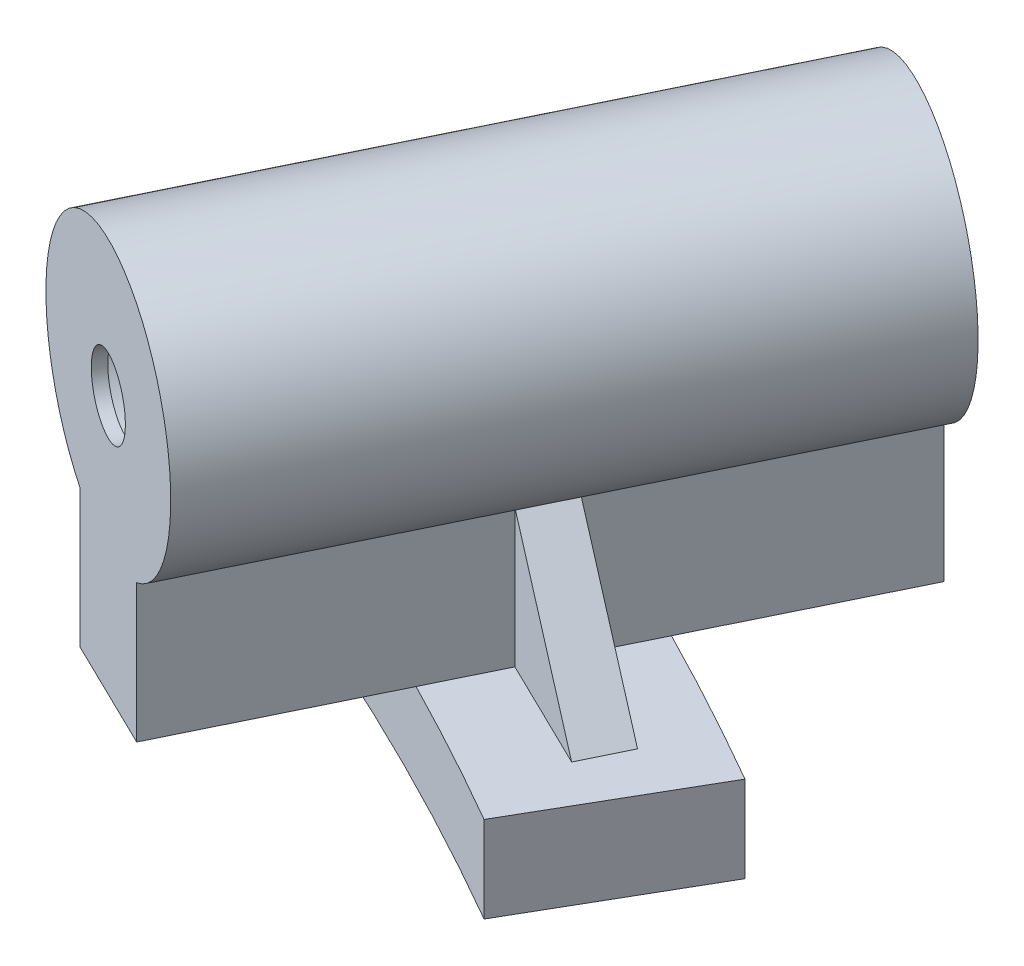
ISO-10303-21;
HEADER;
FILE_DESCRIPTION(('STEP AP214'),'2;1');
FILE_NAME('part.step','',(''),(''),'','','');
FILE_SCHEMA(('AUTOMOTIVE_DESIGN { 1 0 10303 214 1 1 1 1 }'));
ENDSEC;
DATA;
#1=APPLICATION_CONTEXT('core data for automotive mechanical design processes');
#2=APPLICATION_PROTOCOL_DEFINITION('international standard','automotive_design',2000,#1);
#3=PRODUCT_CONTEXT('',#1,'mechanical');
#4=PRODUCT('Part','Part','',(#3));
#5=PRODUCT_RELATED_PRODUCT_CATEGORY('part','',(#4));
#6=PRODUCT_DEFINITION_FORMATION('','',#4);
#7=PRODUCT_DEFINITION_CONTEXT('part definition',#1,'design');
#8=PRODUCT_DEFINITION('design','',#6,#7);
#9=PRODUCT_DEFINITION_SHAPE('','',#8);
#10=(LENGTH_UNIT() NAMED_UNIT(*) SI_UNIT(.MILLI.,.METRE.));
#11=(NAMED_UNIT(*) PLANE_ANGLE_UNIT() SI_UNIT($,.RADIAN.));
#12=(NAMED_UNIT(*) SI_UNIT($,.STERADIAN.) SOLID_ANGLE_UNIT());
#13=UNCERTAINTY_MEASURE_WITH_UNIT(LENGTH_MEASURE(1.E-05),#10,'distance_accuracy_value','');
#14=(GEOMETRIC_REPRESENTATION_CONTEXT(3) GLOBAL_UNCERTAINTY_ASSIGNED_CONTEXT((#13)) GLOBAL_UNIT_ASSIGNED_CONTEXT((#10,
#11,#12)) REPRESENTATION_CONTEXT('',''));
#15=CARTESIAN_POINT('',(0.,0.,0.));
#16=DIRECTION('',(0.,0.,1.));
#17=DIRECTION('',(1.,0.,0.));
#18=AXIS2_PLACEMENT_3D('',#15,#16,#17);
#19=CARTESIAN_POINT('',(99.6195509318094,-1.34114941374719E-13,-215.656208135417));
#20=DIRECTION('',(-0.898794046299167,0.,-0.438371146789078));
#21=DIRECTION('',(-0.438371146789078,0.,0.898794046299167));
#22=AXIS2_PLACEMENT_3D('',#19,#20,#21);
#23=PLANE('',#22);
#24=DIRECTION('',(0.438371146789078,0.,-0.898794046299167));
#25=VECTOR('',#24,1.);
#26=CARTESIAN_POINT('',(99.6195509318094,20.2020410288673,-215.656208135417));
#27=LINE('',#26,#25);
#28=CARTESIAN_POINT('',(117.791632649121,20.2020410288673,-252.914497089915));
#29=VERTEX_POINT('',#28);
#30=CARTESIAN_POINT('',(127.455744952017,20.2020410288673,-272.728863669995));
#31=VERTEX_POINT('',#30);
#32=EDGE_CURVE('E240',#29,#31,#27,.T.);
#33=ORIENTED_EDGE('',*,*,#32,.T.);
#34=DIRECTION('',(0.,-1.,0.));
#35=VECTOR('',#34,1.);
#36=CARTESIAN_POINT('',(127.455744952017,-1.34114941374719E-13,-272.728863669995));
#37=LINE('',#36,#35);
#38=CARTESIAN_POINT('',(127.455744952017,8.99999999991573,-272.728863669995));
#39=VERTEX_POINT('',#38);
#40=EDGE_CURVE('E59',#31,#39,#37,.T.);
#41=ORIENTED_EDGE('',*,*,#40,.T.);
#42=DIRECTION('',(0.438371146789078,0.,-0.898794046299167));
#43=VECTOR('',#42,1.);
#44=CARTESIAN_POINT('',(99.6195509318094,8.99999999991573,-215.656208135417));
#45=LINE('',#44,#43);
#46=CARTESIAN_POINT('',(120.203357984728,8.99999999991573,-257.859266810344));
#47=VERTEX_POINT('',#46);
#48=EDGE_CURVE('E227',#47,#39,#45,.T.);
#49=ORIENTED_EDGE('',*,*,#48,.F.);
#50=CARTESIAN_POINT('',(117.791632649121,8.99999999991573,-252.914497089915));
#51=VERTEX_POINT('',#50);
#52=EDGE_CURVE('E225',#51,#47,#45,.T.);
#53=ORIENTED_EDGE('',*,*,#52,.F.);
#54=DIRECTION('',(0.,1.,0.));
#55=VECTOR('',#54,1.);
#56=CARTESIAN_POINT('',(117.791632649121,-1.34114941374719E-13,-252.914497089915));
#57=LINE('',#56,#55);
#58=EDGE_CURVE('E327',#51,#29,#57,.T.);
#59=ORIENTED_EDGE('',*,*,#58,.T.);
#60=EDGE_LOOP('',(#33,#41,#49,#53,#59));
#61=FACE_BOUND('',#60,.T.);
#62=ADVANCED_FACE('F39',(#61),#23,.T.);
#63=CARTESIAN_POINT('',(108.607491394801,-1.34114941374719E-13,-211.272496667527));
#64=DIRECTION('',(-0.898794046299167,0.,-0.438371146789078));
#65=DIRECTION('',(-0.438371146789078,0.,0.898794046299167));
#66=AXIS2_PLACEMENT_3D('',#63,#64,#65);
#67=PLANE('',#66);
#68=DIRECTION('',(0.,-1.,0.));
#69=VECTOR('',#68,1.);
#70=CARTESIAN_POINT('',(136.443685415008,-1.34114941374719E-13,-268.345152202104));
#71=LINE('',#70,#69);
#72=CARTESIAN_POINT('',(136.443685415008,20.2020410288673,-268.345152202104));
#73=VERTEX_POINT('',#72);
#74=CARTESIAN_POINT('',(136.443685415008,8.99999999991572,-268.345152202104));
#75=VERTEX_POINT('',#74);
#76=EDGE_CURVE('E155',#73,#75,#71,.T.);
#77=ORIENTED_EDGE('',*,*,#76,.F.);
#78=DIRECTION('',(0.438371146789078,0.,-0.898794046299167));
#79=VECTOR('',#78,1.);
#80=CARTESIAN_POINT('',(108.607491394801,20.2020410288673,-211.272496667527));
#81=LINE('',#80,#79);
#82=CARTESIAN_POINT('',(126.779573112113,20.2020410288673,-248.530785622024));
#83=VERTEX_POINT('',#82);
#84=EDGE_CURVE('E168',#83,#73,#81,.T.);
#85=ORIENTED_EDGE('',*,*,#84,.F.);
#86=DIRECTION('',(0.,1.,0.));
#87=VECTOR('',#86,1.);
#88=CARTESIAN_POINT('',(126.779573112113,-1.34114941374719E-13,-248.530785622024));
#89=LINE('',#88,#87);
#90=CARTESIAN_POINT('',(126.779573112113,8.99999999991573,-248.530785622024));
#91=VERTEX_POINT('',#90);
#92=EDGE_CURVE('E303',#91,#83,#89,.T.);
#93=ORIENTED_EDGE('',*,*,#92,.F.);
#94=DIRECTION('',(0.438371146789078,0.,-0.898794046299167));
#95=VECTOR('',#94,1.);
#96=CARTESIAN_POINT('',(108.607491394801,8.99999999991573,-211.272496667527));
#97=LINE('',#96,#95);
#98=CARTESIAN_POINT('',(129.19129844772,8.99999999991573,-253.475555342453));
#99=VERTEX_POINT('',#98);
#100=EDGE_CURVE('E210',#91,#99,#97,.T.);
#101=ORIENTED_EDGE('',*,*,#100,.T.);
#102=EDGE_CURVE('E171',#99,#75,#97,.T.);
#103=ORIENTED_EDGE('',*,*,#102,.T.);
#104=EDGE_LOOP('',(#77,#85,#93,#101,#103));
#105=FACE_BOUND('',#104,.T.);
#106=ADVANCED_FACE('F166',(#105),#67,.F.);
#107=CARTESIAN_POINT('',(-125.999996384804,8.99999999997952,-218.238395491974));
#108=DIRECTION('',(0.,-1.,0.));
#109=DIRECTION('',(0.,0.,-1.));
#110=AXIS2_PLACEMENT_3D('',#107,#108,#109);
#111=PLANE('',#110);
#112=CARTESIAN_POINT('',(114.963496052748,8.99999999991573,-224.30423743481));
#113=VERTEX_POINT('',#112);
#114=CARTESIAN_POINT('',(122.395557001219,8.99999999998975,-239.542220521587));
#115=VERTEX_POINT('',#114);
#116=EDGE_CURVE('E179',#113,#115,#97,.T.);
#117=ORIENTED_EDGE('',*,*,#116,.F.);
#118=DIRECTION('',(-0.898794046299167,0.,-0.438371146789078));
#119=VECTOR('',#118,1.);
#120=CARTESIAN_POINT('',(-77.3042454525741,8.99999999997952,-318.079480696913));
#121=LINE('',#120,#119);
#122=CARTESIAN_POINT('',(105.975555589756,8.99999999991573,-228.687948902701));
#123=VERTEX_POINT('',#122);
#124=EDGE_CURVE('E346',#113,#123,#121,.T.);
#125=ORIENTED_EDGE('',*,*,#124,.T.);
#126=CARTESIAN_POINT('',(113.407596786894,8.99999999991573,-243.925891519969));
#127=VERTEX_POINT('',#126);
#128=EDGE_CURVE('E44',#123,#127,#45,.T.);
#129=ORIENTED_EDGE('',*,*,#128,.T.);
#130=CARTESIAN_POINT('',(0.,8.99999999999999,0.));
#131=DIRECTION('',(0.,-1.,0.));
#132=DIRECTION('',(-0.500000000000001,0.,-0.866025403784438));
#133=AXIS2_PLACEMENT_3D('',#130,#131,#132);
#134=CIRCLE('',#133,268.99999808812);
#135=EDGE_CURVE('E222',#127,#115,#134,.T.);
#136=ORIENTED_EDGE('',*,*,#135,.T.);
#137=EDGE_LOOP('',(#117,#125,#129,#136));
#138=FACE_BOUND('',#137,.T.);
#139=ADVANCED_FACE('F489',(#138),#111,.T.);
#140=CARTESIAN_POINT('',(-142.249998772886,8.99999999995786,-246.384225251248));
#141=DIRECTION('',(0.,-1.,0.));
#142=DIRECTION('',(0.,0.,-1.));
#143=AXIS2_PLACEMENT_3D('',#140,#141,#142);
#144=PLANE('',#143);
#145=ORIENTED_EDGE('',*,*,#48,.T.);
#146=DIRECTION('',(0.898794046299166,0.,0.438371146789079));
#147=VECTOR('',#146,1.);
#148=CARTESIAN_POINT('',(-80.0409157662468,8.99999999995786,-373.931747120886));
#149=LINE('',#148,#147);
#150=EDGE_CURVE('E361',#39,#75,#149,.T.);
#151=ORIENTED_EDGE('',*,*,#150,.T.);
#152=ORIENTED_EDGE('',*,*,#102,.F.);
#153=CARTESIAN_POINT('',(0.,8.99999999991573,0.));
#154=DIRECTION('',(0.,-1.,0.));
#155=DIRECTION('',(-0.500000000000001,0.,-0.866025403784438));
#156=AXIS2_PLACEMENT_3D('',#153,#154,#155);
#157=CIRCLE('',#156,284.499997545772);
#158=EDGE_CURVE('E403',#47,#99,#157,.T.);
#159=ORIENTED_EDGE('',*,*,#158,.F.);
#160=EDGE_LOOP('',(#145,#151,#152,#159));
#161=FACE_BOUND('',#160,.T.);
#162=ADVANCED_FACE('F402',(#161),#144,.T.);
#163=ORIENTED_EDGE('',*,*,#128,.F.);
#164=DIRECTION('',(0.,1.,0.));
#165=VECTOR('',#164,1.);
#166=CARTESIAN_POINT('',(105.975555589756,-1.34114941374719E-13,-228.687948902701));
#167=LINE('',#166,#165);
#168=CARTESIAN_POINT('',(105.975555589756,20.2020410288673,-228.687948902701));
#169=VERTEX_POINT('',#168);
#170=EDGE_CURVE('E349',#123,#169,#167,.T.);
#171=ORIENTED_EDGE('',*,*,#170,.T.);
#172=CARTESIAN_POINT('',(116.038148061965,20.2020410288673,-249.319320904718));
#173=VERTEX_POINT('',#172);
#174=EDGE_CURVE('E235',#169,#173,#27,.T.);
#175=ORIENTED_EDGE('',*,*,#174,.T.);
#176=DIRECTION('',(0.,1.,0.));
#177=VECTOR('',#176,1.);
#178=CARTESIAN_POINT('',(116.038148061965,-1.34114941374719E-13,-249.319320904718));
#179=LINE('',#178,#177);
#180=CARTESIAN_POINT('',(116.038148061965,8.99999999991573,-249.319320904718));
#181=VERTEX_POINT('',#180);
#182=EDGE_CURVE('E319',#181,#173,#179,.T.);
#183=ORIENTED_EDGE('',*,*,#182,.F.);
#184=EDGE_CURVE('E203',#127,#181,#45,.T.);
#185=ORIENTED_EDGE('',*,*,#184,.F.);
#186=EDGE_LOOP('',(#163,#171,#175,#183,#185));
#187=FACE_BOUND('',#186,.T.);
#188=ADVANCED_FACE('F382',(#187),#23,.T.);
#189=DIRECTION('',(0.,1.,0.));
#190=VECTOR('',#189,1.);
#191=CARTESIAN_POINT('',(114.963496052748,-1.34114941374719E-13,-224.30423743481));
#192=LINE('',#191,#190);
#193=CARTESIAN_POINT('',(114.963496052748,20.2020410288673,-224.30423743481));
#194=VERTEX_POINT('',#193);
#195=EDGE_CURVE('E66',#113,#194,#192,.T.);
#196=ORIENTED_EDGE('',*,*,#195,.F.);
#197=ORIENTED_EDGE('',*,*,#116,.T.);
#198=CARTESIAN_POINT('',(125.026088524957,8.99999999991573,-244.935609436827));
#199=VERTEX_POINT('',#198);
#200=EDGE_CURVE('E184',#115,#199,#97,.T.);
#201=ORIENTED_EDGE('',*,*,#200,.T.);
#202=DIRECTION('',(0.,1.,0.));
#203=VECTOR('',#202,1.);
#204=CARTESIAN_POINT('',(125.026088524957,-1.34114941374719E-13,-244.935609436827));
#205=LINE('',#204,#203);
#206=CARTESIAN_POINT('',(125.026088524957,20.2020410288672,-244.935609436828));
#207=VERTEX_POINT('',#206);
#208=EDGE_CURVE('E295',#199,#207,#205,.T.);
#209=ORIENTED_EDGE('',*,*,#208,.T.);
#210=EDGE_CURVE('E181',#194,#207,#81,.T.);
#211=ORIENTED_EDGE('',*,*,#210,.F.);
#212=EDGE_LOOP('',(#196,#197,#201,#209,#211));
#213=FACE_BOUND('',#212,.T.);
#214=ADVANCED_FACE('F386',(#213),#67,.F.);
#215=CARTESIAN_POINT('',(104.113521163305,30.,-213.464352401472));
#216=DIRECTION('',(0.438371146789078,0.,-0.898794046299167));
#217=DIRECTION('',(-0.898794046299167,0.,-0.438371146789078));
#218=AXIS2_PLACEMENT_3D('',#215,#216,#217);
#219=CYLINDRICAL_SURFACE('',#218,11.);
#220=ORIENTED_EDGE('',*,*,#174,.F.);
#221=CARTESIAN_POINT('',(110.469525821252,30.,-226.496093168756));
#222=DIRECTION('',(-0.438371146789078,0.,0.898794046299167));
#223=DIRECTION('',(0.898794046299167,0.,0.438371146789078));
#224=AXIS2_PLACEMENT_3D('',#221,#222,#223);
#225=CIRCLE('',#224,11.);
#226=EDGE_CURVE('E12',#194,#169,#225,.T.);
#227=ORIENTED_EDGE('',*,*,#226,.F.);
#228=ORIENTED_EDGE('',*,*,#210,.T.);
#229=EDGE_CURVE('E177',#207,#83,#81,.T.);
#230=ORIENTED_EDGE('',*,*,#229,.T.);
#231=ORIENTED_EDGE('',*,*,#84,.T.);
#232=CARTESIAN_POINT('',(131.949715183512,30.,-270.537007936049));
#233=DIRECTION('',(0.438371146789079,0.,-0.898794046299166));
#234=DIRECTION('',(-0.898794046299166,0.,-0.438371146789079));
#235=AXIS2_PLACEMENT_3D('',#232,#233,#234);
#236=CIRCLE('',#235,11.);
#237=EDGE_CURVE('E51',#31,#73,#236,.T.);
#238=ORIENTED_EDGE('',*,*,#237,.F.);
#239=ORIENTED_EDGE('',*,*,#32,.F.);
#240=EDGE_CURVE('E239',#173,#29,#27,.T.);
#241=ORIENTED_EDGE('',*,*,#240,.F.);
#242=EDGE_LOOP('',(#220,#227,#228,#230,#231,#238,#239,#241));
#243=FACE_BOUND('',#242,.T.);
#244=ADVANCED_FACE('F175',(#243),#219,.T.);
#245=CARTESIAN_POINT('',(151.,60.,-261.5396719429));
#246=DIRECTION('',(0.866025403784438,0.,0.500000000000001));
#247=DIRECTION('',(0.500000000000001,0.,-0.866025403784438));
#248=AXIS2_PLACEMENT_3D('',#245,#246,#247);
#249=PLANE('',#248);
#250=DIRECTION('',(0.499999999999999,4.81520050514028E-12,-0.866025403784439));
#251=VECTOR('',#250,1.);
#252=CARTESIAN_POINT('',(134.499998786319,1.99999999992535,-232.960831515858));
#253=LINE('',#252,#251);
#254=CARTESIAN_POINT('',(134.499998786319,1.99999999992535,-232.960831515858));
#255=VERTEX_POINT('',#254);
#256=CARTESIAN_POINT('',(142.249999031635,1.99999999999999,-246.384225699416));
#257=VERTEX_POINT('',#256);
#258=EDGE_CURVE('E467',#255,#257,#253,.T.);
#259=ORIENTED_EDGE('',*,*,#258,.T.);
#260=DIRECTION('',(-3.69642211255139E-08,0.999999999999997,6.4023909330181E-08));
#261=VECTOR('',#260,1.);
#262=CARTESIAN_POINT('',(142.249999031635,1.99999999999999,-246.384225699416));
#263=LINE('',#262,#261);
#264=CARTESIAN_POINT('',(142.24999890226,9.00000000057478,-246.384225475333));
#265=VERTEX_POINT('',#264);
#266=EDGE_CURVE('E410',#257,#265,#263,.T.);
#267=ORIENTED_EDGE('',*,*,#266,.T.);
#268=DIRECTION('',(0.499999999999999,2.40871381409738E-12,-0.866025403784439));
#269=VECTOR('',#268,1.);
#270=CARTESIAN_POINT('',(125.999996384803,8.99999999995904,-218.238395491974));
#271=LINE('',#270,#269);
#272=CARTESIAN_POINT('',(134.49999891519,8.99999999999999,-232.960831739068));
#273=VERTEX_POINT('',#272);
#274=EDGE_CURVE('E284',#273,#265,#271,.T.);
#275=ORIENTED_EDGE('',*,*,#274,.F.);
#276=DIRECTION('',(-3.68200842099771E-08,-0.999999999999997,6.37742548432394E-08));
#277=VECTOR('',#276,1.);
#278=CARTESIAN_POINT('',(134.49999904406,8.99999999999999,-232.960831962278));
#279=LINE('',#278,#277);
#280=EDGE_CURVE('E507',#273,#255,#279,.T.);
#281=ORIENTED_EDGE('',*,*,#280,.T.);
#282=EDGE_LOOP('',(#259,#267,#275,#281));
#283=FACE_BOUND('',#282,.T.);
#284=ADVANCED_FACE('F556',(#283),#249,.T.);
#285=CARTESIAN_POINT('',(-4.50354127737838E-13,0.,-1.81954878519174E-13));
#286=DIRECTION('',(0.927183854566808,0.,0.374606593415861));
#287=DIRECTION('',(0.374606593415861,0.,-0.927183854566808));
#288=AXIS2_PLACEMENT_3D('',#285,#286,#287);
#289=PLANE('',#288);
#290=DIRECTION('',(-0.374606593415859,0.,0.927183854566808));
#291=VECTOR('',#290,1.);
#292=CARTESIAN_POINT('',(106.575575826812,1.99999999998548,-263.783806624257));
#293=LINE('',#292,#291);
#294=CARTESIAN_POINT('',(106.575583415354,1.99999999998133,-263.783825402775));
#295=VERTEX_POINT('',#294);
#296=CARTESIAN_POINT('',(100.769172719561,1.99999999992535,-249.412454627862));
#297=VERTEX_POINT('',#296);
#298=EDGE_CURVE('E536',#295,#297,#293,.T.);
#299=ORIENTED_EDGE('',*,*,#298,.T.);
#300=DIRECTION('',(0.,-1.,0.));
#301=VECTOR('',#300,1.);
#302=CARTESIAN_POINT('',(100.769173628866,8.99999999998628,-249.412456878472));
#303=LINE('',#302,#301);
#304=CARTESIAN_POINT('',(100.769176814737,8.99999999991573,-249.412464763779));
#305=VERTEX_POINT('',#304);
#306=EDGE_CURVE('E161',#297,#305,#303,.F.);
#307=ORIENTED_EDGE('',*,*,#306,.T.);
#308=DIRECTION('',(0.374606593415861,0.,-0.927183854566808));
#309=VECTOR('',#308,1.);
#310=CARTESIAN_POINT('',(88.7526604137027,8.99999999991573,-219.670542995712));
#311=LINE('',#310,#309);
#312=CARTESIAN_POINT('',(106.575575004371,8.99999999991573,-263.783804588645));
#313=VERTEX_POINT('',#312);
#314=EDGE_CURVE('E188',#305,#313,#311,.T.);
#315=ORIENTED_EDGE('',*,*,#314,.T.);
#316=DIRECTION('',(0.,-1.,0.));
#317=VECTOR('',#316,1.);
#318=CARTESIAN_POINT('',(106.575575826812,8.99999999998549,-263.783806624257));
#319=LINE('',#318,#317);
#320=EDGE_CURVE('E511',#313,#295,#319,.T.);
#321=ORIENTED_EDGE('',*,*,#320,.T.);
#322=EDGE_LOOP('',(#299,#307,#315,#321));
#323=FACE_BOUND('',#322,.T.);
#324=ADVANCED_FACE('F41',(#323),#289,.F.);
#325=CARTESIAN_POINT('',(-134.49999878632,1.99999999996267,-232.960831515858));
#326=DIRECTION('',(0.,-1.,0.));
#327=DIRECTION('',(0.,0.,-1.));
#328=AXIS2_PLACEMENT_3D('',#325,#326,#327);
#329=PLANE('',#328);
#330=CARTESIAN_POINT('',(0.,1.99999999992535,0.));
#331=DIRECTION('',(0.,-1.,0.));
#332=DIRECTION('',(-0.500000000000001,0.,-0.866025403784438));
#333=AXIS2_PLACEMENT_3D('',#330,#331,#332);
#334=CIRCLE('',#333,268.999997572639);
#335=EDGE_CURVE('E199',#297,#255,#334,.T.);
#336=ORIENTED_EDGE('',*,*,#335,.F.);
#337=ORIENTED_EDGE('',*,*,#298,.F.);
#338=CARTESIAN_POINT('',(0.,1.99999999999999,0.));
#339=DIRECTION('',(0.,-1.,0.));
#340=DIRECTION('',(-0.500000000000001,0.,-0.866025403784438));
#341=AXIS2_PLACEMENT_3D('',#338,#339,#340);
#342=CIRCLE('',#341,284.499998063271);
#343=EDGE_CURVE('E415',#295,#257,#342,.T.);
#344=ORIENTED_EDGE('',*,*,#343,.T.);
#345=ORIENTED_EDGE('',*,*,#258,.F.);
#346=EDGE_LOOP('',(#336,#337,#344,#345));
#347=FACE_BOUND('',#346,.T.);
#348=ADVANCED_FACE('F452',(#347),#329,.T.);
#349=CARTESIAN_POINT('',(0.,-5.,0.));
#350=DIRECTION('',(0.,-1.,0.));
#351=DIRECTION('',(0.,0.,-1.));
#352=AXIS2_PLACEMENT_3D('',#349,#350,#351);
#353=CYLINDRICAL_SURFACE('',#352,284.499997804521);
#354=ORIENTED_EDGE('',*,*,#320,.F.);
#355=EDGE_CURVE('E408',#313,#47,#157,.T.);
#356=ORIENTED_EDGE('',*,*,#355,.T.);
#357=ORIENTED_EDGE('',*,*,#158,.T.);
#358=CARTESIAN_POINT('',(0.,8.9999999998895,0.));
#359=DIRECTION('',(-4.7144160177858E-12,1.,-2.29937432793103E-12));
#360=DIRECTION('',(-1.,-4.7144160177858E-12,0.));
#361=AXIS2_PLACEMENT_3D('',#358,#359,#360);
#362=CIRCLE('',#361,284.499997804521);
#363=EDGE_CURVE('E191',#99,#265,#362,.F.);
#364=ORIENTED_EDGE('',*,*,#363,.T.);
#365=ORIENTED_EDGE('',*,*,#266,.F.);
#366=ORIENTED_EDGE('',*,*,#343,.F.);
#367=EDGE_LOOP('',(#354,#356,#357,#364,#365,#366));
#368=FACE_BOUND('',#367,.T.);
#369=ADVANCED_FACE('F407',(#368),#353,.T.);
#370=CARTESIAN_POINT('',(0.,-5.,0.));
#371=DIRECTION('',(0.,-1.,0.));
#372=DIRECTION('',(0.,0.,-1.));
#373=AXIS2_PLACEMENT_3D('',#370,#371,#372);
#374=CYLINDRICAL_SURFACE('',#373,268.99999783038);
#375=ORIENTED_EDGE('',*,*,#335,.T.);
#376=ORIENTED_EDGE('',*,*,#280,.F.);
#377=EDGE_CURVE('E282',#115,#273,#134,.T.);
#378=ORIENTED_EDGE('',*,*,#377,.F.);
#379=ORIENTED_EDGE('',*,*,#135,.F.);
#380=EDGE_CURVE('E245',#305,#127,#134,.T.);
#381=ORIENTED_EDGE('',*,*,#380,.F.);
#382=ORIENTED_EDGE('',*,*,#306,.F.);
#383=EDGE_LOOP('',(#375,#376,#378,#379,#381,#382));
#384=FACE_BOUND('',#383,.T.);
#385=ADVANCED_FACE('F264',(#384),#374,.F.);
#386=CARTESIAN_POINT('',(104.113521163305,8.99999999991573,-213.464352401472));
#387=DIRECTION('',(0.,1.,0.));
#388=DIRECTION('',(0.,0.,1.));
#389=AXIS2_PLACEMENT_3D('',#386,#387,#388);
#390=PLANE('',#389);
#391=DIRECTION('',(0.898794046299165,0.,0.438371146789081));
#392=VECTOR('',#391,1.);
#393=CARTESIAN_POINT('',(120.532118293461,8.99999999991573,-247.127465170773));
#394=LINE('',#393,#392);
#395=CARTESIAN_POINT('',(107.050207598973,8.99999999991573,-253.703032372609));
#396=VERTEX_POINT('',#395);
#397=EDGE_CURVE('E323',#396,#181,#394,.T.);
#398=ORIENTED_EDGE('',*,*,#397,.F.);
#399=DIRECTION('',(-0.438371146789081,0.,0.898794046299165));
#400=VECTOR('',#399,1.);
#401=CARTESIAN_POINT('',(90.6316104688177,8.99999999991573,-220.039919603308));
#402=LINE('',#401,#400);
#403=CARTESIAN_POINT('',(108.80369218613,8.99999999991573,-257.298208557806));
#404=VERTEX_POINT('',#403);
#405=EDGE_CURVE('E312',#404,#396,#402,.T.);
#406=ORIENTED_EDGE('',*,*,#405,.F.);
#407=DIRECTION('',(0.898794046299165,0.,0.438371146789081));
#408=VECTOR('',#407,1.);
#409=CARTESIAN_POINT('',(122.285602880617,8.99999999991573,-250.72264135597));
#410=LINE('',#409,#408);
#411=EDGE_CURVE('E331',#404,#51,#410,.T.);
#412=ORIENTED_EDGE('',*,*,#411,.T.);
#413=ORIENTED_EDGE('',*,*,#52,.T.);
#414=ORIENTED_EDGE('',*,*,#355,.F.);
#415=ORIENTED_EDGE('',*,*,#314,.F.);
#416=ORIENTED_EDGE('',*,*,#380,.T.);
#417=ORIENTED_EDGE('',*,*,#184,.T.);
#418=EDGE_LOOP('',(#398,#406,#412,#413,#414,#415,#416,#417));
#419=FACE_BOUND('',#418,.T.);
#420=ADVANCED_FACE('F253',(#419),#390,.T.);
#421=CARTESIAN_POINT('',(104.113521163263,8.9999999998895,-213.464352401493));
#422=DIRECTION('',(-4.7144160177858E-12,1.,-2.29937432793103E-12));
#423=DIRECTION('',(-1.,-4.7144160177858E-12,0.));
#424=AXIS2_PLACEMENT_3D('',#421,#422,#423);
#425=PLANE('',#424);
#426=ORIENTED_EDGE('',*,*,#274,.T.);
#427=ORIENTED_EDGE('',*,*,#363,.F.);
#428=ORIENTED_EDGE('',*,*,#100,.F.);
#429=DIRECTION('',(0.898794046299165,5.24526840959579E-12,0.438371146789081));
#430=VECTOR('',#429,1.);
#431=CARTESIAN_POINT('',(122.285602880575,8.9999999998895,-250.72264135599));
#432=LINE('',#431,#430);
#433=CARTESIAN_POINT('',(135.76751358566,8.99999999996818,-244.147074148985));
#434=VERTEX_POINT('',#433);
#435=EDGE_CURVE('E299',#91,#434,#432,.T.);
#436=ORIENTED_EDGE('',*,*,#435,.T.);
#437=DIRECTION('',(-0.438371146789081,0.,0.898794046299165));
#438=VECTOR('',#437,1.);
#439=CARTESIAN_POINT('',(117.595431868348,8.99999999996818,-206.888785194488));
#440=LINE('',#439,#438);
#441=CARTESIAN_POINT('',(134.014028998504,8.99999999996818,-240.551897963788));
#442=VERTEX_POINT('',#441);
#443=EDGE_CURVE('E287',#442,#434,#440,.F.);
#444=ORIENTED_EDGE('',*,*,#443,.F.);
#445=DIRECTION('',(0.898794046299165,5.24526840959579E-12,0.438371146789081));
#446=VECTOR('',#445,1.);
#447=CARTESIAN_POINT('',(120.532118293418,8.9999999998895,-247.127465170794));
#448=LINE('',#447,#446);
#449=EDGE_CURVE('E292',#199,#442,#448,.T.);
#450=ORIENTED_EDGE('',*,*,#449,.F.);
#451=ORIENTED_EDGE('',*,*,#200,.F.);
#452=ORIENTED_EDGE('',*,*,#377,.T.);
#453=EDGE_LOOP('',(#426,#427,#428,#436,#444,#450,#451,#452));
#454=FACE_BOUND('',#453,.T.);
#455=ADVANCED_FACE('F263',(#454),#425,.T.);
#456=CARTESIAN_POINT('',(125.902830818535,20.2020410288673,-246.733197529426));
#457=DIRECTION('',(-0.670498516044579,-0.665948240136343,-0.327023976859994));
#458=DIRECTION('',(0.598550313377952,-0.745997950036934,0.291932493730738));
#459=AXIS2_PLACEMENT_3D('',#456,#457,#458);
#460=PLANE('',#459);
#461=DIRECTION('',(0.598550313377952,-0.745997950036934,0.291932493730738));
#462=VECTOR('',#461,1.);
#463=CARTESIAN_POINT('',(125.026088524957,20.2020410288673,-244.935609436828));
#464=LINE('',#463,#462);
#465=EDGE_CURVE('E307',#207,#442,#464,.T.);
#466=ORIENTED_EDGE('',*,*,#465,.T.);
#467=ORIENTED_EDGE('',*,*,#443,.T.);
#468=DIRECTION('',(0.598550313377952,-0.745997950036934,0.291932493730738));
#469=VECTOR('',#468,1.);
#470=CARTESIAN_POINT('',(126.779573112113,20.2020410288673,-248.530785622024));
#471=LINE('',#470,#469);
#472=EDGE_CURVE('E308',#83,#434,#471,.T.);
#473=ORIENTED_EDGE('',*,*,#472,.F.);
#474=ORIENTED_EDGE('',*,*,#229,.F.);
#475=EDGE_LOOP('',(#466,#467,#473,#474));
#476=FACE_BOUND('',#475,.T.);
#477=ADVANCED_FACE('F269',(#476),#460,.F.);
#478=CARTESIAN_POINT('',(120.564982398737,21.78807864224,-247.111436275636));
#479=DIRECTION('',(-0.438371146789081,0.,0.898794046299165));
#480=DIRECTION('',(0.898794046299165,0.,0.438371146789081));
#481=AXIS2_PLACEMENT_3D('',#478,#479,#480);
#482=PLANE('',#481);
#483=ORIENTED_EDGE('',*,*,#208,.F.);
#484=ORIENTED_EDGE('',*,*,#449,.T.);
#485=ORIENTED_EDGE('',*,*,#465,.F.);
#486=EDGE_LOOP('',(#483,#484,#485));
#487=FACE_BOUND('',#486,.T.);
#488=ADVANCED_FACE('F391',(#487),#482,.T.);
#489=CARTESIAN_POINT('',(122.318466985893,21.78807864224,-250.706612460833));
#490=DIRECTION('',(-0.438371146789081,0.,0.898794046299165));
#491=DIRECTION('',(0.898794046299165,0.,0.438371146789081));
#492=AXIS2_PLACEMENT_3D('',#489,#490,#491);
#493=PLANE('',#492);
#494=ORIENTED_EDGE('',*,*,#435,.F.);
#495=ORIENTED_EDGE('',*,*,#92,.T.);
#496=ORIENTED_EDGE('',*,*,#472,.T.);
#497=EDGE_LOOP('',(#494,#495,#496));
#498=FACE_BOUND('',#497,.T.);
#499=ADVANCED_FACE('F396',(#498),#493,.F.);
#500=CARTESIAN_POINT('',(116.914890355543,20.2020410288673,-251.116908997317));
#501=DIRECTION('',(-0.670498516395192,0.665948239699359,-0.327023977031));
#502=DIRECTION('',(-0.598550312985193,-0.745997950427027,-0.29193249353918));
#503=AXIS2_PLACEMENT_3D('',#500,#501,#502);
#504=PLANE('',#503);
#505=DIRECTION('',(-0.598550312985193,-0.745997950427027,-0.29193249353918));
#506=VECTOR('',#505,1.);
#507=CARTESIAN_POINT('',(117.791632649121,20.2020410288673,-252.914497089915));
#508=LINE('',#507,#506);
#509=EDGE_CURVE('E335',#29,#404,#508,.T.);
#510=ORIENTED_EDGE('',*,*,#509,.T.);
#511=ORIENTED_EDGE('',*,*,#405,.T.);
#512=DIRECTION('',(-0.598550312985193,-0.745997950427027,-0.29193249353918));
#513=VECTOR('',#512,1.);
#514=CARTESIAN_POINT('',(116.038148061965,20.2020410288673,-249.319320904718));
#515=LINE('',#514,#513);
#516=EDGE_CURVE('E334',#173,#396,#515,.T.);
#517=ORIENTED_EDGE('',*,*,#516,.F.);
#518=ORIENTED_EDGE('',*,*,#240,.T.);
#519=EDGE_LOOP('',(#510,#511,#517,#518));
#520=FACE_BOUND('',#519,.T.);
#521=ADVANCED_FACE('F374',(#520),#504,.T.);
#522=CARTESIAN_POINT('',(122.318466985893,21.78807864224,-250.706612460833));
#523=DIRECTION('',(-0.438371146789081,0.,0.898794046299165));
#524=DIRECTION('',(0.898794046299165,0.,0.438371146789081));
#525=AXIS2_PLACEMENT_3D('',#522,#523,#524);
#526=PLANE('',#525);
#527=ORIENTED_EDGE('',*,*,#58,.F.);
#528=ORIENTED_EDGE('',*,*,#411,.F.);
#529=ORIENTED_EDGE('',*,*,#509,.F.);
#530=EDGE_LOOP('',(#527,#528,#529));
#531=FACE_BOUND('',#530,.T.);
#532=ADVANCED_FACE('F377',(#531),#526,.F.);
#533=CARTESIAN_POINT('',(120.564982398737,21.78807864224,-247.111436275636));
#534=DIRECTION('',(-0.438371146789081,0.,0.898794046299165));
#535=DIRECTION('',(0.898794046299165,0.,0.438371146789081));
#536=AXIS2_PLACEMENT_3D('',#533,#534,#535);
#537=PLANE('',#536);
#538=ORIENTED_EDGE('',*,*,#397,.T.);
#539=ORIENTED_EDGE('',*,*,#182,.T.);
#540=ORIENTED_EDGE('',*,*,#516,.T.);
#541=EDGE_LOOP('',(#538,#539,#540));
#542=FACE_BOUND('',#541,.T.);
#543=ADVANCED_FACE('F379',(#542),#537,.T.);
#544=CARTESIAN_POINT('',(131.949715183513,41.6163195311752,-270.537007936049));
#545=DIRECTION('',(0.438371146789079,0.,-0.898794046299166));
#546=DIRECTION('',(-0.898794046299166,0.,-0.438371146789079));
#547=AXIS2_PLACEMENT_3D('',#544,#545,#546);
#548=PLANE('',#547);
#549=CARTESIAN_POINT('',(131.949715183512,30.,-270.537007936049));
#550=DIRECTION('',(0.438371146789079,0.,-0.898794046299166));
#551=DIRECTION('',(-0.898794046299166,0.,-0.438371146789079));
#552=AXIS2_PLACEMENT_3D('',#549,#550,#551);
#553=CIRCLE('',#552,6.5);
#554=CARTESIAN_POINT('',(126.107553882568,30.,-273.386420390178));
#555=VERTEX_POINT('',#554);
#556=EDGE_CURVE('E357',#555,#555,#553,.T.);
#557=ORIENTED_EDGE('',*,*,#556,.F.);
#558=EDGE_LOOP('',(#557));
#559=FACE_BOUND('',#558,.T.);
#560=ORIENTED_EDGE('',*,*,#40,.F.);
#561=ORIENTED_EDGE('',*,*,#237,.T.);
#562=ORIENTED_EDGE('',*,*,#76,.T.);
#563=ORIENTED_EDGE('',*,*,#150,.F.);
#564=EDGE_LOOP('',(#560,#561,#562,#563));
#565=FACE_BOUND('',#564,.T.);
#566=ADVANCED_FACE('F154',(#559,#565),#548,.T.);
#567=CARTESIAN_POINT('',(110.469525821252,41.6163195311752,-226.496093168755));
#568=DIRECTION('',(-0.438371146789078,0.,0.898794046299167));
#569=DIRECTION('',(0.898794046299167,0.,0.438371146789078));
#570=AXIS2_PLACEMENT_3D('',#567,#568,#569);
#571=PLANE('',#570);
#572=CARTESIAN_POINT('',(110.469525821252,30.,-226.496093168756));
#573=DIRECTION('',(-0.438371146789078,0.,0.898794046299167));
#574=DIRECTION('',(0.898794046299167,0.,0.438371146789078));
#575=AXIS2_PLACEMENT_3D('',#572,#573,#574);
#576=CIRCLE('',#575,3.);
#577=CARTESIAN_POINT('',(113.165907960149,30.,-225.180979728388));
#578=VERTEX_POINT('',#577);
#579=EDGE_CURVE('E339',#578,#578,#576,.T.);
#580=ORIENTED_EDGE('',*,*,#579,.F.);
#581=EDGE_LOOP('',(#580));
#582=FACE_BOUND('',#581,.T.);
#583=ORIENTED_EDGE('',*,*,#226,.T.);
#584=ORIENTED_EDGE('',*,*,#170,.F.);
#585=ORIENTED_EDGE('',*,*,#124,.F.);
#586=ORIENTED_EDGE('',*,*,#195,.T.);
#587=EDGE_LOOP('',(#583,#584,#585,#586));
#588=FACE_BOUND('',#587,.T.);
#589=ADVANCED_FACE('F601',(#582,#588),#571,.T.);
#590=CARTESIAN_POINT('',(56.9484551435837,30.,-116.761636352896));
#591=DIRECTION('',(0.438371146789078,0.,-0.898794046299167));
#592=DIRECTION('',(-0.898794046299167,0.,-0.438371146789078));
#593=AXIS2_PLACEMENT_3D('',#590,#591,#592);
#594=CYLINDRICAL_SURFACE('',#593,3.);
#595=CARTESIAN_POINT('',(110.907900137637,30.,-227.394893713689));
#596=DIRECTION('',(-0.438371146789078,0.,0.898794046299167));
#597=DIRECTION('',(0.898794046299167,0.,0.438371146789078));
#598=AXIS2_PLACEMENT_3D('',#595,#596,#597);
#599=CIRCLE('',#598,3.);
#600=CARTESIAN_POINT('',(113.604282276534,30.,-226.079780273322));
#601=VERTEX_POINT('',#600);
#602=EDGE_CURVE('E497',#601,#601,#599,.T.);
#603=ORIENTED_EDGE('',*,*,#602,.F.);
#604=EDGE_LOOP('',(#603));
#605=FACE_BOUND('',#604,.T.);
#606=ORIENTED_EDGE('',*,*,#579,.T.);
#607=EDGE_LOOP('',(#606));
#608=FACE_BOUND('',#607,.T.);
#609=ADVANCED_FACE('F611',(#605,#608),#594,.F.);
#610=CARTESIAN_POINT('',(110.907900137637,30.,-227.394893713689));
#611=DIRECTION('',(-0.438371146789078,0.,0.898794046299167));
#612=DIRECTION('',(0.898794046299167,0.,0.438371146789078));
#613=AXIS2_PLACEMENT_3D('',#610,#611,#612);
#614=PLANE('',#613);
#615=CARTESIAN_POINT('',(110.907900137637,30.,-227.394893713689));
#616=DIRECTION('',(-0.438371146789078,0.,0.898794046299167));
#617=DIRECTION('',(0.898794046299167,0.,0.438371146789078));
#618=AXIS2_PLACEMENT_3D('',#615,#616,#617);
#619=CIRCLE('',#618,6.5);
#620=CARTESIAN_POINT('',(116.750061438581,30.,-224.54548125956));
#621=VERTEX_POINT('',#620);
#622=EDGE_CURVE('E506',#621,#621,#619,.T.);
#623=ORIENTED_EDGE('',*,*,#622,.F.);
#624=EDGE_LOOP('',(#623));
#625=FACE_BOUND('',#624,.T.);
#626=ORIENTED_EDGE('',*,*,#602,.T.);
#627=EDGE_LOOP('',(#626));
#628=FACE_BOUND('',#627,.T.);
#629=ADVANCED_FACE('F491',(#625,#628),#614,.F.);
#630=CARTESIAN_POINT('',(110.907900137637,30.,-227.394893713689));
#631=DIRECTION('',(0.438371146789077,0.,-0.898794046299167));
#632=DIRECTION('',(-0.898794046299167,0.,-0.438371146789078));
#633=AXIS2_PLACEMENT_3D('',#630,#631,#632);
#634=CYLINDRICAL_SURFACE('',#633,6.5);
#635=ORIENTED_EDGE('',*,*,#622,.T.);
#636=EDGE_LOOP('',(#635));
#637=FACE_BOUND('',#636,.T.);
#638=ORIENTED_EDGE('',*,*,#556,.T.);
#639=EDGE_LOOP('',(#638));
#640=FACE_BOUND('',#639,.T.);
#641=ADVANCED_FACE('F630',(#637,#640),#634,.F.);
#642=CLOSED_SHELL('',(#62,#106,#139,#162,#188,#214,#244,#284,#324,#348,#369,#385,#420,#455,#477,
#488,#499,#521,#532,#543,#566,#589,#609,#629,#641));
#643=MANIFOLD_SOLID_BREP('B2',#642);
#644=ADVANCED_BREP_SHAPE_REPRESENTATION('',(#18,#643),#14);
#645=SHAPE_DEFINITION_REPRESENTATION(#9,#644);
ENDSEC;
END-ISO-10303-21;
